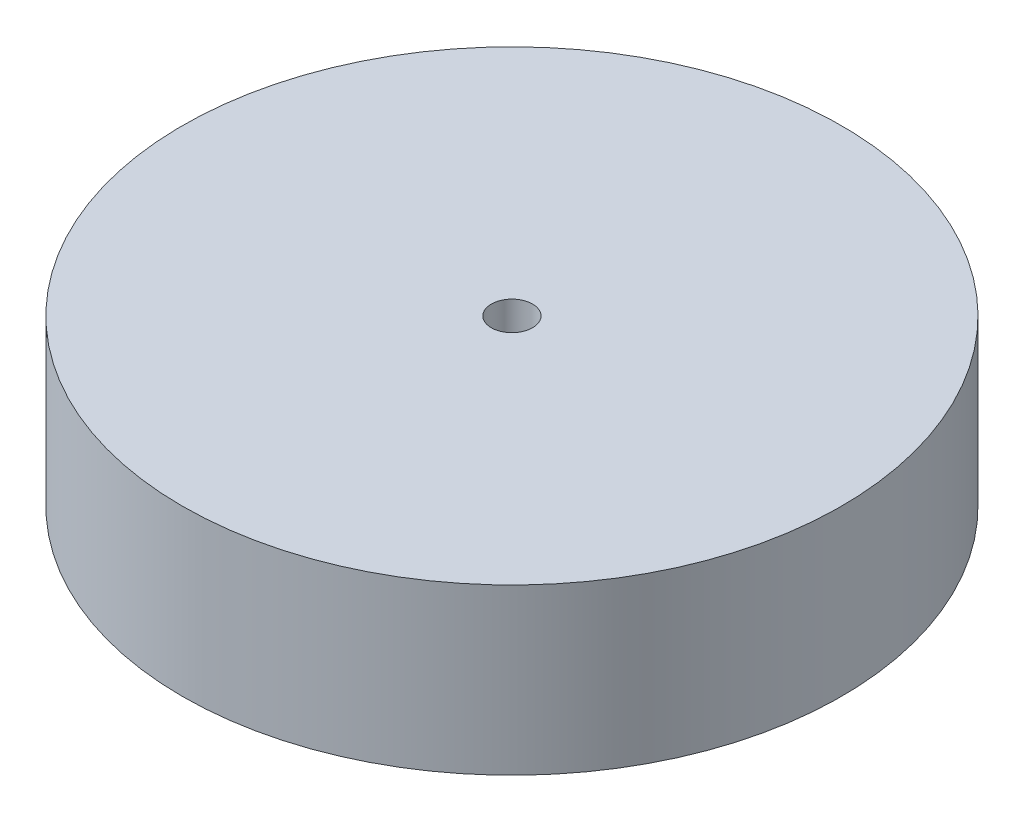
ISO-10303-21;
HEADER;
FILE_DESCRIPTION(('STEP AP214'),'2;1');
FILE_NAME('part.step','',(''),(''),'','','');
FILE_SCHEMA(('AUTOMOTIVE_DESIGN { 1 0 10303 214 1 1 1 1 }'));
ENDSEC;
DATA;
#1=APPLICATION_CONTEXT('core data for automotive mechanical design processes');
#2=APPLICATION_PROTOCOL_DEFINITION('international standard','automotive_design',2000,#1);
#3=PRODUCT_CONTEXT('',#1,'mechanical');
#4=PRODUCT('Part','Part','',(#3));
#5=PRODUCT_RELATED_PRODUCT_CATEGORY('part','',(#4));
#6=PRODUCT_DEFINITION_FORMATION('','',#4);
#7=PRODUCT_DEFINITION_CONTEXT('part definition',#1,'design');
#8=PRODUCT_DEFINITION('design','',#6,#7);
#9=PRODUCT_DEFINITION_SHAPE('','',#8);
#10=(LENGTH_UNIT() NAMED_UNIT(*) SI_UNIT(.MILLI.,.METRE.));
#11=(NAMED_UNIT(*) PLANE_ANGLE_UNIT() SI_UNIT($,.RADIAN.));
#12=(NAMED_UNIT(*) SI_UNIT($,.STERADIAN.) SOLID_ANGLE_UNIT());
#13=UNCERTAINTY_MEASURE_WITH_UNIT(LENGTH_MEASURE(1.E-05),#10,'distance_accuracy_value','');
#14=(GEOMETRIC_REPRESENTATION_CONTEXT(3) GLOBAL_UNCERTAINTY_ASSIGNED_CONTEXT((#13)) GLOBAL_UNIT_ASSIGNED_CONTEXT((#10,
#11,#12)) REPRESENTATION_CONTEXT('',''));
#15=CARTESIAN_POINT('',(0.,0.,0.));
#16=DIRECTION('',(0.,0.,1.));
#17=DIRECTION('',(1.,0.,0.));
#18=AXIS2_PLACEMENT_3D('',#15,#16,#17);
#19=CARTESIAN_POINT('',(0.,25.4,0.));
#20=DIRECTION('',(0.,-1.,0.));
#21=DIRECTION('',(0.,0.,-1.));
#22=AXIS2_PLACEMENT_3D('',#19,#20,#21);
#23=CYLINDRICAL_SURFACE('',#22,50.8);
#24=CARTESIAN_POINT('',(0.,25.4,0.));
#25=DIRECTION('',(0.,1.,0.));
#26=DIRECTION('',(0.,0.,1.));
#27=AXIS2_PLACEMENT_3D('',#24,#25,#26);
#28=CIRCLE('',#27,50.8);
#29=CARTESIAN_POINT('',(0.,25.4,50.8));
#30=VERTEX_POINT('',#29);
#31=EDGE_CURVE('E10',#30,#30,#28,.T.);
#32=ORIENTED_EDGE('',*,*,#31,.F.);
#33=EDGE_LOOP('',(#32));
#34=FACE_BOUND('',#33,.T.);
#35=CARTESIAN_POINT('',(0.,0.,0.));
#36=DIRECTION('',(0.,1.,0.));
#37=DIRECTION('',(0.,0.,1.));
#38=AXIS2_PLACEMENT_3D('',#35,#36,#37);
#39=CIRCLE('',#38,50.8);
#40=CARTESIAN_POINT('',(0.,0.,50.8));
#41=VERTEX_POINT('',#40);
#42=EDGE_CURVE('E36',#41,#41,#39,.T.);
#43=ORIENTED_EDGE('',*,*,#42,.T.);
#44=EDGE_LOOP('',(#43));
#45=FACE_BOUND('',#44,.T.);
#46=ADVANCED_FACE('F33',(#34,#45),#23,.T.);
#47=CARTESIAN_POINT('',(0.,25.4,0.));
#48=DIRECTION('',(0.,1.,0.));
#49=DIRECTION('',(0.,0.,1.));
#50=AXIS2_PLACEMENT_3D('',#47,#48,#49);
#51=PLANE('',#50);
#52=CARTESIAN_POINT('',(0.,25.4,0.));
#53=DIRECTION('',(0.,1.,0.));
#54=DIRECTION('',(0.,0.,1.));
#55=AXIS2_PLACEMENT_3D('',#52,#53,#54);
#56=CIRCLE('',#55,3.175);
#57=CARTESIAN_POINT('',(0.,25.4,3.175));
#58=VERTEX_POINT('',#57);
#59=EDGE_CURVE('E45',#58,#58,#56,.T.);
#60=ORIENTED_EDGE('',*,*,#59,.F.);
#61=EDGE_LOOP('',(#60));
#62=FACE_BOUND('',#61,.T.);
#63=ORIENTED_EDGE('',*,*,#31,.T.);
#64=EDGE_LOOP('',(#63));
#65=FACE_BOUND('',#64,.T.);
#66=ADVANCED_FACE('F60',(#62,#65),#51,.T.);
#67=CARTESIAN_POINT('',(0.,0.,0.));
#68=DIRECTION('',(0.,1.,0.));
#69=DIRECTION('',(0.,0.,1.));
#70=AXIS2_PLACEMENT_3D('',#67,#68,#69);
#71=PLANE('',#70);
#72=CARTESIAN_POINT('',(0.,0.,0.));
#73=DIRECTION('',(0.,1.,0.));
#74=DIRECTION('',(0.,0.,1.));
#75=AXIS2_PLACEMENT_3D('',#72,#73,#74);
#76=CIRCLE('',#75,3.175);
#77=CARTESIAN_POINT('',(0.,0.,3.175));
#78=VERTEX_POINT('',#77);
#79=EDGE_CURVE('E43',#78,#78,#76,.T.);
#80=ORIENTED_EDGE('',*,*,#79,.T.);
#81=EDGE_LOOP('',(#80));
#82=FACE_BOUND('',#81,.T.);
#83=ORIENTED_EDGE('',*,*,#42,.F.);
#84=EDGE_LOOP('',(#83));
#85=FACE_BOUND('',#84,.T.);
#86=ADVANCED_FACE('F51',(#82,#85),#71,.F.);
#87=CARTESIAN_POINT('',(0.,0.,0.));
#88=DIRECTION('',(0.,1.,0.));
#89=DIRECTION('',(0.,0.,1.));
#90=AXIS2_PLACEMENT_3D('',#87,#88,#89);
#91=CYLINDRICAL_SURFACE('',#90,3.175);
#92=ORIENTED_EDGE('',*,*,#79,.F.);
#93=EDGE_LOOP('',(#92));
#94=FACE_BOUND('',#93,.T.);
#95=ORIENTED_EDGE('',*,*,#59,.T.);
#96=EDGE_LOOP('',(#95));
#97=FACE_BOUND('',#96,.T.);
#98=ADVANCED_FACE('F54',(#94,#97),#91,.F.);
#99=CLOSED_SHELL('',(#46,#66,#86,#98));
#100=MANIFOLD_SOLID_BREP('B2',#99);
#101=ADVANCED_BREP_SHAPE_REPRESENTATION('',(#18,#100),#14);
#102=SHAPE_DEFINITION_REPRESENTATION(#9,#101);
ENDSEC;
END-ISO-10303-21;
